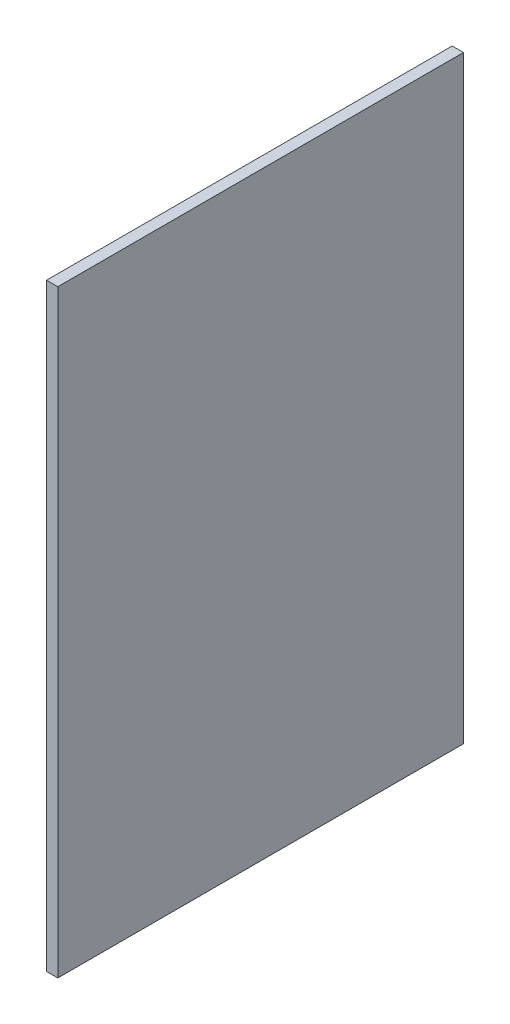
ISO-10303-21;
HEADER;
FILE_DESCRIPTION(('STEP AP214'),'2;1');
FILE_NAME('part.step','',(''),(''),'','','');
FILE_SCHEMA(('AUTOMOTIVE_DESIGN { 1 0 10303 214 1 1 1 1 }'));
ENDSEC;
DATA;
#1=APPLICATION_CONTEXT('core data for automotive mechanical design processes');
#2=APPLICATION_PROTOCOL_DEFINITION('international standard','automotive_design',2000,#1);
#3=PRODUCT_CONTEXT('',#1,'mechanical');
#4=PRODUCT('Part','Part','',(#3));
#5=PRODUCT_RELATED_PRODUCT_CATEGORY('part','',(#4));
#6=PRODUCT_DEFINITION_FORMATION('','',#4);
#7=PRODUCT_DEFINITION_CONTEXT('part definition',#1,'design');
#8=PRODUCT_DEFINITION('design','',#6,#7);
#9=PRODUCT_DEFINITION_SHAPE('','',#8);
#10=(LENGTH_UNIT() NAMED_UNIT(*) SI_UNIT(.MILLI.,.METRE.));
#11=(NAMED_UNIT(*) PLANE_ANGLE_UNIT() SI_UNIT($,.RADIAN.));
#12=(NAMED_UNIT(*) SI_UNIT($,.STERADIAN.) SOLID_ANGLE_UNIT());
#13=UNCERTAINTY_MEASURE_WITH_UNIT(LENGTH_MEASURE(1.E-05),#10,'distance_accuracy_value','');
#14=(GEOMETRIC_REPRESENTATION_CONTEXT(3) GLOBAL_UNCERTAINTY_ASSIGNED_CONTEXT((#13)) GLOBAL_UNIT_ASSIGNED_CONTEXT((#10,
#11,#12)) REPRESENTATION_CONTEXT('',''));
#15=CARTESIAN_POINT('',(0.,0.,0.));
#16=DIRECTION('',(0.,0.,1.));
#17=DIRECTION('',(1.,0.,0.));
#18=AXIS2_PLACEMENT_3D('',#15,#16,#17);
#19=CARTESIAN_POINT('',(-16.,0.,0.));
#20=DIRECTION('',(0.,0.,1.));
#21=DIRECTION('',(1.,0.,0.));
#22=AXIS2_PLACEMENT_3D('',#19,#20,#21);
#23=PLANE('',#22);
#24=DIRECTION('',(0.,-1.,0.));
#25=VECTOR('',#24,1.);
#26=CARTESIAN_POINT('',(0.,0.,0.));
#27=LINE('',#26,#25);
#28=CARTESIAN_POINT('',(0.,850.,0.));
#29=VERTEX_POINT('',#28);
#30=CARTESIAN_POINT('',(0.,0.,0.));
#31=VERTEX_POINT('',#30);
#32=EDGE_CURVE('E95',#29,#31,#27,.T.);
#33=ORIENTED_EDGE('',*,*,#32,.F.);
#34=DIRECTION('',(1.,0.,0.));
#35=VECTOR('',#34,1.);
#36=CARTESIAN_POINT('',(-16.,850.,0.));
#37=LINE('',#36,#35);
#38=CARTESIAN_POINT('',(-16.,850.,0.));
#39=VERTEX_POINT('',#38);
#40=EDGE_CURVE('E11',#39,#29,#37,.T.);
#41=ORIENTED_EDGE('',*,*,#40,.F.);
#42=DIRECTION('',(0.,-1.,0.));
#43=VECTOR('',#42,1.);
#44=CARTESIAN_POINT('',(-16.,0.,0.));
#45=LINE('',#44,#43);
#46=CARTESIAN_POINT('',(-16.,0.,0.));
#47=VERTEX_POINT('',#46);
#48=EDGE_CURVE('E89',#39,#47,#45,.T.);
#49=ORIENTED_EDGE('',*,*,#48,.T.);
#50=DIRECTION('',(1.,0.,0.));
#51=VECTOR('',#50,1.);
#52=CARTESIAN_POINT('',(-16.,0.,0.));
#53=LINE('',#52,#51);
#54=EDGE_CURVE('E34',#47,#31,#53,.T.);
#55=ORIENTED_EDGE('',*,*,#54,.T.);
#56=EDGE_LOOP('',(#33,#41,#49,#55));
#57=FACE_BOUND('',#56,.T.);
#58=ADVANCED_FACE('F31',(#57),#23,.T.);
#59=CARTESIAN_POINT('',(-16.,850.,0.));
#60=DIRECTION('',(0.,1.,0.));
#61=DIRECTION('',(0.,0.,1.));
#62=AXIS2_PLACEMENT_3D('',#59,#60,#61);
#63=PLANE('',#62);
#64=DIRECTION('',(0.,0.,1.));
#65=VECTOR('',#64,1.);
#66=CARTESIAN_POINT('',(0.,850.,0.));
#67=LINE('',#66,#65);
#68=CARTESIAN_POINT('',(0.,850.,-576.));
#69=VERTEX_POINT('',#68);
#70=EDGE_CURVE('E91',#69,#29,#67,.T.);
#71=ORIENTED_EDGE('',*,*,#70,.F.);
#72=DIRECTION('',(1.,0.,0.));
#73=VECTOR('',#72,1.);
#74=CARTESIAN_POINT('',(-16.,850.,-576.));
#75=LINE('',#74,#73);
#76=CARTESIAN_POINT('',(-16.,850.,-576.));
#77=VERTEX_POINT('',#76);
#78=EDGE_CURVE('E40',#77,#69,#75,.T.);
#79=ORIENTED_EDGE('',*,*,#78,.F.);
#80=DIRECTION('',(0.,0.,1.));
#81=VECTOR('',#80,1.);
#82=CARTESIAN_POINT('',(-16.,850.,0.));
#83=LINE('',#82,#81);
#84=EDGE_CURVE('E86',#77,#39,#83,.T.);
#85=ORIENTED_EDGE('',*,*,#84,.T.);
#86=ORIENTED_EDGE('',*,*,#40,.T.);
#87=EDGE_LOOP('',(#71,#79,#85,#86));
#88=FACE_BOUND('',#87,.T.);
#89=ADVANCED_FACE('F105',(#88),#63,.T.);
#90=CARTESIAN_POINT('',(-16.,0.,-576.));
#91=DIRECTION('',(0.,0.,-1.));
#92=DIRECTION('',(-1.,0.,0.));
#93=AXIS2_PLACEMENT_3D('',#90,#91,#92);
#94=PLANE('',#93);
#95=DIRECTION('',(0.,1.,0.));
#96=VECTOR('',#95,1.);
#97=CARTESIAN_POINT('',(0.,0.,-576.));
#98=LINE('',#97,#96);
#99=CARTESIAN_POINT('',(0.,0.,-576.));
#100=VERTEX_POINT('',#99);
#101=EDGE_CURVE('E81',#100,#69,#98,.T.);
#102=ORIENTED_EDGE('',*,*,#101,.F.);
#103=DIRECTION('',(1.,0.,0.));
#104=VECTOR('',#103,1.);
#105=CARTESIAN_POINT('',(-16.,0.,-576.));
#106=LINE('',#105,#104);
#107=CARTESIAN_POINT('',(-16.,0.,-576.));
#108=VERTEX_POINT('',#107);
#109=EDGE_CURVE('E76',#108,#100,#106,.T.);
#110=ORIENTED_EDGE('',*,*,#109,.F.);
#111=DIRECTION('',(0.,1.,0.));
#112=VECTOR('',#111,1.);
#113=CARTESIAN_POINT('',(-16.,0.,-576.));
#114=LINE('',#113,#112);
#115=EDGE_CURVE('E79',#108,#77,#114,.T.);
#116=ORIENTED_EDGE('',*,*,#115,.T.);
#117=ORIENTED_EDGE('',*,*,#78,.T.);
#118=EDGE_LOOP('',(#102,#110,#116,#117));
#119=FACE_BOUND('',#118,.T.);
#120=ADVANCED_FACE('F78',(#119),#94,.T.);
#121=CARTESIAN_POINT('',(-16.,0.,0.));
#122=DIRECTION('',(0.,-1.,0.));
#123=DIRECTION('',(0.,0.,-1.));
#124=AXIS2_PLACEMENT_3D('',#121,#122,#123);
#125=PLANE('',#124);
#126=DIRECTION('',(0.,0.,-1.));
#127=VECTOR('',#126,1.);
#128=CARTESIAN_POINT('',(0.,0.,0.));
#129=LINE('',#128,#127);
#130=EDGE_CURVE('E98',#31,#100,#129,.T.);
#131=ORIENTED_EDGE('',*,*,#130,.F.);
#132=ORIENTED_EDGE('',*,*,#54,.F.);
#133=DIRECTION('',(0.,0.,-1.));
#134=VECTOR('',#133,1.);
#135=CARTESIAN_POINT('',(-16.,0.,0.));
#136=LINE('',#135,#134);
#137=EDGE_CURVE('E85',#47,#108,#136,.T.);
#138=ORIENTED_EDGE('',*,*,#137,.T.);
#139=ORIENTED_EDGE('',*,*,#109,.T.);
#140=EDGE_LOOP('',(#131,#132,#138,#139));
#141=FACE_BOUND('',#140,.T.);
#142=ADVANCED_FACE('F88',(#141),#125,.T.);
#143=CARTESIAN_POINT('',(-16.,850.,0.));
#144=DIRECTION('',(-1.,0.,0.));
#145=DIRECTION('',(0.,0.,1.));
#146=AXIS2_PLACEMENT_3D('',#143,#144,#145);
#147=PLANE('',#146);
#148=ORIENTED_EDGE('',*,*,#48,.F.);
#149=ORIENTED_EDGE('',*,*,#84,.F.);
#150=ORIENTED_EDGE('',*,*,#115,.F.);
#151=ORIENTED_EDGE('',*,*,#137,.F.);
#152=EDGE_LOOP('',(#148,#149,#150,#151));
#153=FACE_BOUND('',#152,.T.);
#154=ADVANCED_FACE('F84',(#153),#147,.T.);
#155=CARTESIAN_POINT('',(0.,850.,0.));
#156=DIRECTION('',(-1.,0.,0.));
#157=DIRECTION('',(0.,0.,1.));
#158=AXIS2_PLACEMENT_3D('',#155,#156,#157);
#159=PLANE('',#158);
#160=ORIENTED_EDGE('',*,*,#32,.T.);
#161=ORIENTED_EDGE('',*,*,#130,.T.);
#162=ORIENTED_EDGE('',*,*,#101,.T.);
#163=ORIENTED_EDGE('',*,*,#70,.T.);
#164=EDGE_LOOP('',(#160,#161,#162,#163));
#165=FACE_BOUND('',#164,.T.);
#166=ADVANCED_FACE('F104',(#165),#159,.F.);
#167=CLOSED_SHELL('',(#58,#89,#120,#142,#154,#166));
#168=MANIFOLD_SOLID_BREP('B2',#167);
#169=ADVANCED_BREP_SHAPE_REPRESENTATION('',(#18,#168),#14);
#170=SHAPE_DEFINITION_REPRESENTATION(#9,#169);
ENDSEC;
END-ISO-10303-21;
